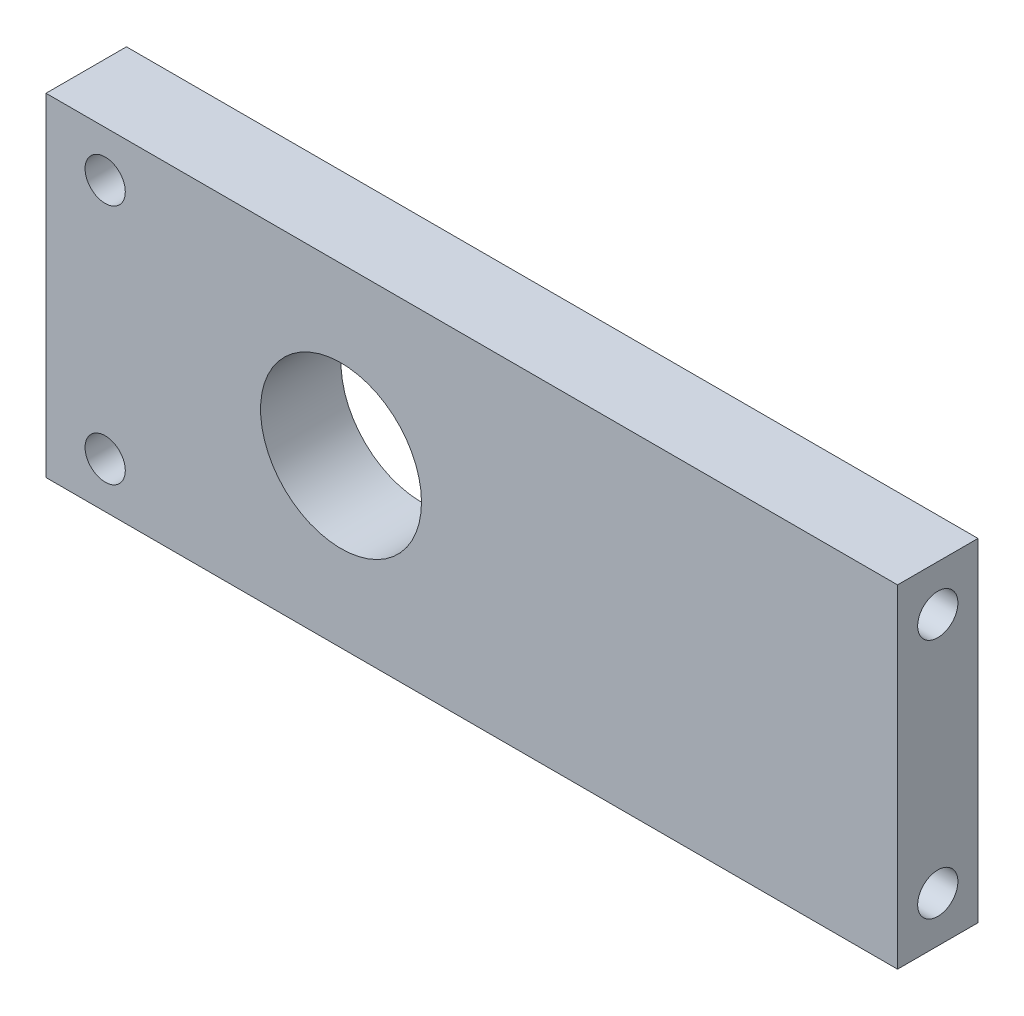
ISO-10303-21;
HEADER;
FILE_DESCRIPTION(('STEP AP214'),'2;1');
FILE_NAME('part.step','',(''),(''),'','','');
FILE_SCHEMA(('AUTOMOTIVE_DESIGN { 1 0 10303 214 1 1 1 1 }'));
ENDSEC;
DATA;
#1=APPLICATION_CONTEXT('core data for automotive mechanical design processes');
#2=APPLICATION_PROTOCOL_DEFINITION('international standard','automotive_design',2000,#1);
#3=PRODUCT_CONTEXT('',#1,'mechanical');
#4=PRODUCT('Part','Part','',(#3));
#5=PRODUCT_RELATED_PRODUCT_CATEGORY('part','',(#4));
#6=PRODUCT_DEFINITION_FORMATION('','',#4);
#7=PRODUCT_DEFINITION_CONTEXT('part definition',#1,'design');
#8=PRODUCT_DEFINITION('design','',#6,#7);
#9=PRODUCT_DEFINITION_SHAPE('','',#8);
#10=(LENGTH_UNIT() NAMED_UNIT(*) SI_UNIT(.MILLI.,.METRE.));
#11=(NAMED_UNIT(*) PLANE_ANGLE_UNIT() SI_UNIT($,.RADIAN.));
#12=(NAMED_UNIT(*) SI_UNIT($,.STERADIAN.) SOLID_ANGLE_UNIT());
#13=UNCERTAINTY_MEASURE_WITH_UNIT(LENGTH_MEASURE(1.E-05),#10,'distance_accuracy_value','');
#14=(GEOMETRIC_REPRESENTATION_CONTEXT(3) GLOBAL_UNCERTAINTY_ASSIGNED_CONTEXT((#13)) GLOBAL_UNIT_ASSIGNED_CONTEXT((#10,
#11,#12)) REPRESENTATION_CONTEXT('',''));
#15=CARTESIAN_POINT('',(0.,0.,0.));
#16=DIRECTION('',(0.,0.,1.));
#17=DIRECTION('',(1.,0.,0.));
#18=AXIS2_PLACEMENT_3D('',#15,#16,#17);
#19=CARTESIAN_POINT('',(0.,0.,6.));
#20=DIRECTION('',(0.,0.,1.));
#21=DIRECTION('',(1.,0.,0.));
#22=AXIS2_PLACEMENT_3D('',#19,#20,#21);
#23=PLANE('',#22);
#24=CARTESIAN_POINT('',(-14.0318935840795,-10.4022598870056,6.));
#25=DIRECTION('',(0.,0.,1.));
#26=DIRECTION('',(1.,0.,0.));
#27=AXIS2_PLACEMENT_3D('',#24,#25,#26);
#28=CIRCLE('',#27,1.5);
#29=CARTESIAN_POINT('',(-12.5318935840795,-10.4022598870056,6.));
#30=VERTEX_POINT('',#29);
#31=EDGE_CURVE('E135',#30,#30,#28,.T.);
#32=ORIENTED_EDGE('',*,*,#31,.F.);
#33=EDGE_LOOP('',(#32));
#34=FACE_BOUND('',#33,.T.);
#35=CARTESIAN_POINT('',(-14.0318935840795,7.59774011299436,6.));
#36=DIRECTION('',(0.,0.,1.));
#37=DIRECTION('',(1.,0.,0.));
#38=AXIS2_PLACEMENT_3D('',#35,#36,#37);
#39=CIRCLE('',#38,1.5);
#40=CARTESIAN_POINT('',(-12.5318935840795,7.59774011299436,6.));
#41=VERTEX_POINT('',#40);
#42=EDGE_CURVE('E127',#41,#41,#39,.T.);
#43=ORIENTED_EDGE('',*,*,#42,.F.);
#44=EDGE_LOOP('',(#43));
#45=FACE_BOUND('',#44,.T.);
#46=DIRECTION('',(0.,-1.,0.));
#47=VECTOR('',#46,1.);
#48=CARTESIAN_POINT('',(-18.445099321793,11.0077401129944,6.));
#49=LINE('',#48,#47);
#50=CARTESIAN_POINT('',(-18.445099321793,11.0077401129944,6.));
#51=VERTEX_POINT('',#50);
#52=CARTESIAN_POINT('',(-18.445099321793,-13.8122598870056,6.));
#53=VERTEX_POINT('',#52);
#54=EDGE_CURVE('E85',#51,#53,#49,.T.);
#55=ORIENTED_EDGE('',*,*,#54,.T.);
#56=DIRECTION('',(1.,0.,0.));
#57=VECTOR('',#56,1.);
#58=CARTESIAN_POINT('',(-18.445099321793,-13.8122598870056,6.));
#59=LINE('',#58,#57);
#60=CARTESIAN_POINT('',(45.054900678207,-13.8122598870056,6.));
#61=VERTEX_POINT('',#60);
#62=EDGE_CURVE('E80',#53,#61,#59,.T.);
#63=ORIENTED_EDGE('',*,*,#62,.T.);
#64=DIRECTION('',(0.,1.,0.));
#65=VECTOR('',#64,1.);
#66=CARTESIAN_POINT('',(45.054900678207,11.0077401129944,6.));
#67=LINE('',#66,#65);
#68=CARTESIAN_POINT('',(45.054900678207,11.0077401129944,6.));
#69=VERTEX_POINT('',#68);
#70=EDGE_CURVE('E83',#61,#69,#67,.T.);
#71=ORIENTED_EDGE('',*,*,#70,.T.);
#72=DIRECTION('',(-1.,0.,0.));
#73=VECTOR('',#72,1.);
#74=CARTESIAN_POINT('',(-18.445099321793,11.0077401129944,6.));
#75=LINE('',#74,#73);
#76=EDGE_CURVE('E50',#69,#51,#75,.T.);
#77=ORIENTED_EDGE('',*,*,#76,.T.);
#78=EDGE_LOOP('',(#55,#63,#71,#77));
#79=FACE_BOUND('',#78,.T.);
#80=CARTESIAN_POINT('',(3.55490067820702,-1.40225988700565,6.));
#81=DIRECTION('',(0.,0.,1.));
#82=DIRECTION('',(1.,0.,0.));
#83=AXIS2_PLACEMENT_3D('',#80,#81,#82);
#84=CIRCLE('',#83,6.);
#85=CARTESIAN_POINT('',(9.55490067820702,-1.40225988700565,6.));
#86=VERTEX_POINT('',#85);
#87=EDGE_CURVE('E100',#86,#86,#84,.T.);
#88=ORIENTED_EDGE('',*,*,#87,.F.);
#89=EDGE_LOOP('',(#88));
#90=FACE_BOUND('',#89,.T.);
#91=ADVANCED_FACE('F33',(#34,#45,#79,#90),#23,.T.);
#92=CARTESIAN_POINT('',(0.,0.,0.));
#93=DIRECTION('',(0.,0.,1.));
#94=DIRECTION('',(1.,0.,0.));
#95=AXIS2_PLACEMENT_3D('',#92,#93,#94);
#96=PLANE('',#95);
#97=CARTESIAN_POINT('',(-14.0318935840795,-10.4022598870056,0.));
#98=DIRECTION('',(0.,0.,-1.));
#99=DIRECTION('',(-1.,0.,0.));
#100=AXIS2_PLACEMENT_3D('',#97,#98,#99);
#101=CIRCLE('',#100,1.5);
#102=CARTESIAN_POINT('',(-15.5318935840795,-10.4022598870056,0.));
#103=VERTEX_POINT('',#102);
#104=EDGE_CURVE('E138',#103,#103,#101,.T.);
#105=ORIENTED_EDGE('',*,*,#104,.F.);
#106=EDGE_LOOP('',(#105));
#107=FACE_BOUND('',#106,.T.);
#108=CARTESIAN_POINT('',(-14.0318935840795,7.59774011299436,0.));
#109=DIRECTION('',(0.,0.,-1.));
#110=DIRECTION('',(-1.,0.,0.));
#111=AXIS2_PLACEMENT_3D('',#108,#109,#110);
#112=CIRCLE('',#111,1.5);
#113=CARTESIAN_POINT('',(-15.5318935840795,7.59774011299436,0.));
#114=VERTEX_POINT('',#113);
#115=EDGE_CURVE('E132',#114,#114,#112,.T.);
#116=ORIENTED_EDGE('',*,*,#115,.F.);
#117=EDGE_LOOP('',(#116));
#118=FACE_BOUND('',#117,.T.);
#119=DIRECTION('',(0.,-1.,0.));
#120=VECTOR('',#119,1.);
#121=CARTESIAN_POINT('',(-18.445099321793,11.0077401129944,0.));
#122=LINE('',#121,#120);
#123=CARTESIAN_POINT('',(-18.445099321793,11.0077401129944,0.));
#124=VERTEX_POINT('',#123);
#125=CARTESIAN_POINT('',(-18.445099321793,-13.8122598870056,0.));
#126=VERTEX_POINT('',#125);
#127=EDGE_CURVE('E97',#124,#126,#122,.T.);
#128=ORIENTED_EDGE('',*,*,#127,.F.);
#129=DIRECTION('',(-1.,0.,0.));
#130=VECTOR('',#129,1.);
#131=CARTESIAN_POINT('',(-18.445099321793,11.0077401129944,0.));
#132=LINE('',#131,#130);
#133=CARTESIAN_POINT('',(45.054900678207,11.0077401129944,0.));
#134=VERTEX_POINT('',#133);
#135=EDGE_CURVE('E73',#134,#124,#132,.T.);
#136=ORIENTED_EDGE('',*,*,#135,.F.);
#137=DIRECTION('',(0.,1.,0.));
#138=VECTOR('',#137,1.);
#139=CARTESIAN_POINT('',(45.054900678207,11.0077401129944,0.));
#140=LINE('',#139,#138);
#141=CARTESIAN_POINT('',(45.054900678207,-13.8122598870056,0.));
#142=VERTEX_POINT('',#141);
#143=EDGE_CURVE('E67',#142,#134,#140,.T.);
#144=ORIENTED_EDGE('',*,*,#143,.F.);
#145=DIRECTION('',(1.,0.,0.));
#146=VECTOR('',#145,1.);
#147=CARTESIAN_POINT('',(-18.445099321793,-13.8122598870056,0.));
#148=LINE('',#147,#146);
#149=EDGE_CURVE('E89',#126,#142,#148,.T.);
#150=ORIENTED_EDGE('',*,*,#149,.F.);
#151=EDGE_LOOP('',(#128,#136,#144,#150));
#152=FACE_BOUND('',#151,.T.);
#153=CARTESIAN_POINT('',(3.55490067820702,-1.40225988700565,0.));
#154=DIRECTION('',(0.,0.,1.));
#155=DIRECTION('',(1.,0.,0.));
#156=AXIS2_PLACEMENT_3D('',#153,#154,#155);
#157=CIRCLE('',#156,6.);
#158=CARTESIAN_POINT('',(9.55490067820702,-1.40225988700565,0.));
#159=VERTEX_POINT('',#158);
#160=EDGE_CURVE('E112',#159,#159,#157,.T.);
#161=ORIENTED_EDGE('',*,*,#160,.T.);
#162=EDGE_LOOP('',(#161));
#163=FACE_BOUND('',#162,.T.);
#164=ADVANCED_FACE('F108',(#107,#118,#152,#163),#96,.F.);
#165=CARTESIAN_POINT('',(-18.445099321793,11.0077401129944,6.));
#166=DIRECTION('',(1.,0.,0.));
#167=DIRECTION('',(0.,0.,-1.));
#168=AXIS2_PLACEMENT_3D('',#165,#166,#167);
#169=PLANE('',#168);
#170=ORIENTED_EDGE('',*,*,#127,.T.);
#171=DIRECTION('',(0.,0.,-1.));
#172=VECTOR('',#171,1.);
#173=CARTESIAN_POINT('',(-18.445099321793,-13.8122598870056,6.));
#174=LINE('',#173,#172);
#175=EDGE_CURVE('E11',#53,#126,#174,.T.);
#176=ORIENTED_EDGE('',*,*,#175,.F.);
#177=ORIENTED_EDGE('',*,*,#54,.F.);
#178=DIRECTION('',(0.,0.,-1.));
#179=VECTOR('',#178,1.);
#180=CARTESIAN_POINT('',(-18.445099321793,11.0077401129944,6.));
#181=LINE('',#180,#179);
#182=EDGE_CURVE('E93',#51,#124,#181,.T.);
#183=ORIENTED_EDGE('',*,*,#182,.T.);
#184=EDGE_LOOP('',(#170,#176,#177,#183));
#185=FACE_BOUND('',#184,.T.);
#186=ADVANCED_FACE('F35',(#185),#169,.F.);
#187=CARTESIAN_POINT('',(-18.445099321793,-13.8122598870056,6.));
#188=DIRECTION('',(0.,1.,0.));
#189=DIRECTION('',(-1.,0.,0.));
#190=AXIS2_PLACEMENT_3D('',#187,#188,#189);
#191=PLANE('',#190);
#192=ORIENTED_EDGE('',*,*,#149,.T.);
#193=DIRECTION('',(0.,0.,-1.));
#194=VECTOR('',#193,1.);
#195=CARTESIAN_POINT('',(45.054900678207,-13.8122598870056,6.));
#196=LINE('',#195,#194);
#197=EDGE_CURVE('E42',#61,#142,#196,.T.);
#198=ORIENTED_EDGE('',*,*,#197,.F.);
#199=ORIENTED_EDGE('',*,*,#62,.F.);
#200=ORIENTED_EDGE('',*,*,#175,.T.);
#201=EDGE_LOOP('',(#192,#198,#199,#200));
#202=FACE_BOUND('',#201,.T.);
#203=ADVANCED_FACE('F88',(#202),#191,.F.);
#204=CARTESIAN_POINT('',(45.054900678207,11.0077401129944,6.));
#205=DIRECTION('',(-1.,0.,0.));
#206=DIRECTION('',(0.,0.,1.));
#207=AXIS2_PLACEMENT_3D('',#204,#205,#206);
#208=PLANE('',#207);
#209=CARTESIAN_POINT('',(45.054900678207,-10.4022598870056,3.));
#210=DIRECTION('',(1.,0.,0.));
#211=DIRECTION('',(0.,0.,-1.));
#212=AXIS2_PLACEMENT_3D('',#209,#210,#211);
#213=CIRCLE('',#212,1.5);
#214=CARTESIAN_POINT('',(45.054900678207,-10.4022598870056,1.5));
#215=VERTEX_POINT('',#214);
#216=EDGE_CURVE('E124',#215,#215,#213,.T.);
#217=ORIENTED_EDGE('',*,*,#216,.F.);
#218=EDGE_LOOP('',(#217));
#219=FACE_BOUND('',#218,.T.);
#220=CARTESIAN_POINT('',(45.054900678207,7.59774011299436,3.));
#221=DIRECTION('',(1.,0.,0.));
#222=DIRECTION('',(0.,0.,-1.));
#223=AXIS2_PLACEMENT_3D('',#220,#221,#222);
#224=CIRCLE('',#223,1.5);
#225=CARTESIAN_POINT('',(45.054900678207,7.59774011299436,1.5));
#226=VERTEX_POINT('',#225);
#227=EDGE_CURVE('E118',#226,#226,#224,.T.);
#228=ORIENTED_EDGE('',*,*,#227,.F.);
#229=EDGE_LOOP('',(#228));
#230=FACE_BOUND('',#229,.T.);
#231=ORIENTED_EDGE('',*,*,#143,.T.);
#232=DIRECTION('',(0.,0.,-1.));
#233=VECTOR('',#232,1.);
#234=CARTESIAN_POINT('',(45.054900678207,11.0077401129944,6.));
#235=LINE('',#234,#233);
#236=EDGE_CURVE('E90',#69,#134,#235,.T.);
#237=ORIENTED_EDGE('',*,*,#236,.F.);
#238=ORIENTED_EDGE('',*,*,#70,.F.);
#239=ORIENTED_EDGE('',*,*,#197,.T.);
#240=EDGE_LOOP('',(#231,#237,#238,#239));
#241=FACE_BOUND('',#240,.T.);
#242=ADVANCED_FACE('F91',(#219,#230,#241),#208,.F.);
#243=CARTESIAN_POINT('',(-18.445099321793,11.0077401129944,6.));
#244=DIRECTION('',(0.,-1.,0.));
#245=DIRECTION('',(0.,0.,-1.));
#246=AXIS2_PLACEMENT_3D('',#243,#244,#245);
#247=PLANE('',#246);
#248=ORIENTED_EDGE('',*,*,#135,.T.);
#249=ORIENTED_EDGE('',*,*,#182,.F.);
#250=ORIENTED_EDGE('',*,*,#76,.F.);
#251=ORIENTED_EDGE('',*,*,#236,.T.);
#252=EDGE_LOOP('',(#248,#249,#250,#251));
#253=FACE_BOUND('',#252,.T.);
#254=ADVANCED_FACE('F105',(#253),#247,.F.);
#255=CARTESIAN_POINT('',(3.55490067820702,-1.40225988700565,6.));
#256=DIRECTION('',(0.,0.,-1.));
#257=DIRECTION('',(-1.,0.,0.));
#258=AXIS2_PLACEMENT_3D('',#255,#256,#257);
#259=CYLINDRICAL_SURFACE('',#258,6.);
#260=ORIENTED_EDGE('',*,*,#87,.T.);
#261=EDGE_LOOP('',(#260));
#262=FACE_BOUND('',#261,.T.);
#263=ORIENTED_EDGE('',*,*,#160,.F.);
#264=EDGE_LOOP('',(#263));
#265=FACE_BOUND('',#264,.T.);
#266=ADVANCED_FACE('F171',(#262,#265),#259,.F.);
#267=CARTESIAN_POINT('',(35.054900678207,7.59774011299436,3.));
#268=DIRECTION('',(1.,0.,0.));
#269=DIRECTION('',(0.,0.,-1.));
#270=AXIS2_PLACEMENT_3D('',#267,#268,#269);
#271=CYLINDRICAL_SURFACE('',#270,1.5);
#272=CARTESIAN_POINT('',(35.054900678207,7.59774011299436,3.));
#273=DIRECTION('',(1.,0.,0.));
#274=DIRECTION('',(0.,0.,-1.));
#275=AXIS2_PLACEMENT_3D('',#272,#273,#274);
#276=CIRCLE('',#275,1.5);
#277=CARTESIAN_POINT('',(35.054900678207,7.59774011299436,1.5));
#278=VERTEX_POINT('',#277);
#279=EDGE_CURVE('E115',#278,#278,#276,.T.);
#280=ORIENTED_EDGE('',*,*,#279,.F.);
#281=EDGE_LOOP('',(#280));
#282=FACE_BOUND('',#281,.T.);
#283=ORIENTED_EDGE('',*,*,#227,.T.);
#284=EDGE_LOOP('',(#283));
#285=FACE_BOUND('',#284,.T.);
#286=ADVANCED_FACE('F224',(#282,#285),#271,.F.);
#287=CARTESIAN_POINT('',(35.054900678207,7.59774011299436,3.));
#288=DIRECTION('',(1.,0.,0.));
#289=DIRECTION('',(0.,0.,-1.));
#290=AXIS2_PLACEMENT_3D('',#287,#288,#289);
#291=PLANE('',#290);
#292=ORIENTED_EDGE('',*,*,#279,.T.);
#293=EDGE_LOOP('',(#292));
#294=FACE_BOUND('',#293,.T.);
#295=ADVANCED_FACE('F215',(#294),#291,.T.);
#296=CARTESIAN_POINT('',(35.054900678207,-10.4022598870056,3.));
#297=DIRECTION('',(1.,0.,0.));
#298=DIRECTION('',(0.,0.,-1.));
#299=AXIS2_PLACEMENT_3D('',#296,#297,#298);
#300=CYLINDRICAL_SURFACE('',#299,1.5);
#301=CARTESIAN_POINT('',(35.054900678207,-10.4022598870056,3.));
#302=DIRECTION('',(1.,0.,0.));
#303=DIRECTION('',(0.,0.,-1.));
#304=AXIS2_PLACEMENT_3D('',#301,#302,#303);
#305=CIRCLE('',#304,1.5);
#306=CARTESIAN_POINT('',(35.054900678207,-10.4022598870056,1.5));
#307=VERTEX_POINT('',#306);
#308=EDGE_CURVE('E121',#307,#307,#305,.T.);
#309=ORIENTED_EDGE('',*,*,#308,.F.);
#310=EDGE_LOOP('',(#309));
#311=FACE_BOUND('',#310,.T.);
#312=ORIENTED_EDGE('',*,*,#216,.T.);
#313=EDGE_LOOP('',(#312));
#314=FACE_BOUND('',#313,.T.);
#315=ADVANCED_FACE('F160',(#311,#314),#300,.F.);
#316=CARTESIAN_POINT('',(35.054900678207,-10.4022598870056,3.));
#317=DIRECTION('',(1.,0.,0.));
#318=DIRECTION('',(0.,0.,-1.));
#319=AXIS2_PLACEMENT_3D('',#316,#317,#318);
#320=PLANE('',#319);
#321=ORIENTED_EDGE('',*,*,#308,.T.);
#322=EDGE_LOOP('',(#321));
#323=FACE_BOUND('',#322,.T.);
#324=ADVANCED_FACE('F151',(#323),#320,.T.);
#325=CARTESIAN_POINT('',(-14.0318935840795,7.59774011299436,10.));
#326=DIRECTION('',(0.,0.,-1.));
#327=DIRECTION('',(-1.,0.,0.));
#328=AXIS2_PLACEMENT_3D('',#325,#326,#327);
#329=CYLINDRICAL_SURFACE('',#328,1.5);
#330=ORIENTED_EDGE('',*,*,#42,.T.);
#331=EDGE_LOOP('',(#330));
#332=FACE_BOUND('',#331,.T.);
#333=ORIENTED_EDGE('',*,*,#115,.T.);
#334=EDGE_LOOP('',(#333));
#335=FACE_BOUND('',#334,.T.);
#336=ADVANCED_FACE('F149',(#332,#335),#329,.F.);
#337=CARTESIAN_POINT('',(-14.0318935840795,-10.4022598870056,10.));
#338=DIRECTION('',(0.,0.,-1.));
#339=DIRECTION('',(-1.,0.,0.));
#340=AXIS2_PLACEMENT_3D('',#337,#338,#339);
#341=CYLINDRICAL_SURFACE('',#340,1.5);
#342=ORIENTED_EDGE('',*,*,#31,.T.);
#343=EDGE_LOOP('',(#342));
#344=FACE_BOUND('',#343,.T.);
#345=ORIENTED_EDGE('',*,*,#104,.T.);
#346=EDGE_LOOP('',(#345));
#347=FACE_BOUND('',#346,.T.);
#348=ADVANCED_FACE('F142',(#344,#347),#341,.F.);
#349=CLOSED_SHELL('',(#91,#164,#186,#203,#242,#254,#266,#286,#295,#315,#324,#336,#348));
#350=MANIFOLD_SOLID_BREP('B2',#349);
#351=ADVANCED_BREP_SHAPE_REPRESENTATION('',(#18,#350),#14);
#352=SHAPE_DEFINITION_REPRESENTATION(#9,#351);
ENDSEC;
END-ISO-10303-21;
